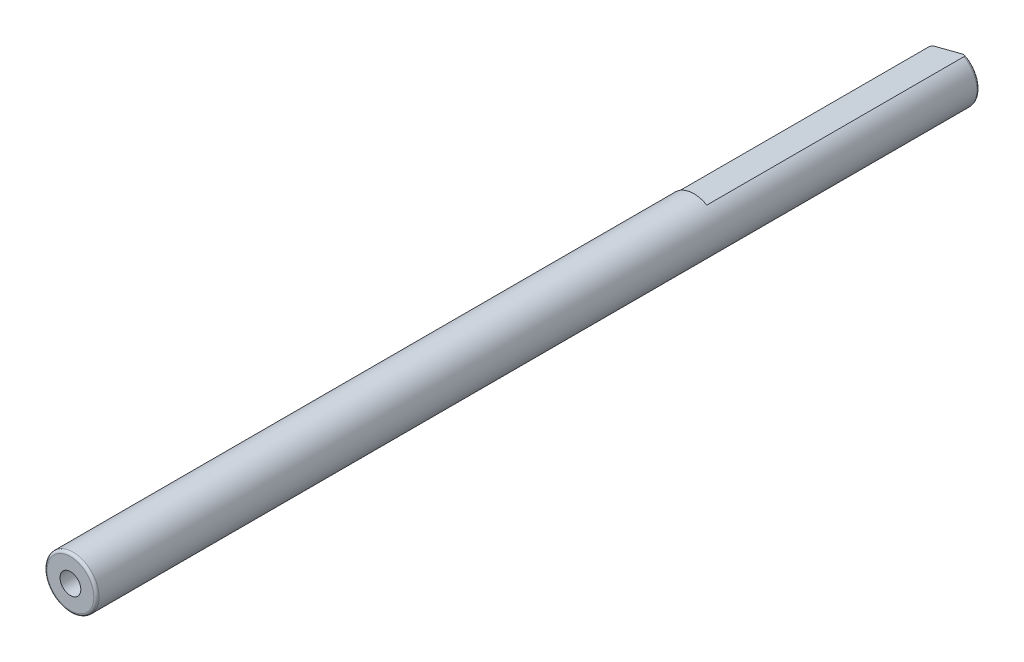
ISO-10303-21;
HEADER;
FILE_DESCRIPTION(('STEP AP214'),'2;1');
FILE_NAME('part.step','',(''),(''),'','','');
FILE_SCHEMA(('AUTOMOTIVE_DESIGN { 1 0 10303 214 1 1 1 1 }'));
ENDSEC;
DATA;
#1=APPLICATION_CONTEXT('core data for automotive mechanical design processes');
#2=APPLICATION_PROTOCOL_DEFINITION('international standard','automotive_design',2000,#1);
#3=PRODUCT_CONTEXT('',#1,'mechanical');
#4=PRODUCT('Part','Part','',(#3));
#5=PRODUCT_RELATED_PRODUCT_CATEGORY('part','',(#4));
#6=PRODUCT_DEFINITION_FORMATION('','',#4);
#7=PRODUCT_DEFINITION_CONTEXT('part definition',#1,'design');
#8=PRODUCT_DEFINITION('design','',#6,#7);
#9=PRODUCT_DEFINITION_SHAPE('','',#8);
#10=(LENGTH_UNIT() NAMED_UNIT(*) SI_UNIT(.MILLI.,.METRE.));
#11=(NAMED_UNIT(*) PLANE_ANGLE_UNIT() SI_UNIT($,.RADIAN.));
#12=(NAMED_UNIT(*) SI_UNIT($,.STERADIAN.) SOLID_ANGLE_UNIT());
#13=UNCERTAINTY_MEASURE_WITH_UNIT(LENGTH_MEASURE(1.E-05),#10,'distance_accuracy_value','');
#14=(GEOMETRIC_REPRESENTATION_CONTEXT(3) GLOBAL_UNCERTAINTY_ASSIGNED_CONTEXT((#13)) GLOBAL_UNIT_ASSIGNED_CONTEXT((#10,
#11,#12)) REPRESENTATION_CONTEXT('',''));
#15=CARTESIAN_POINT('',(0.,0.,0.));
#16=DIRECTION('',(0.,0.,1.));
#17=DIRECTION('',(1.,0.,0.));
#18=AXIS2_PLACEMENT_3D('',#15,#16,#17);
#19=CARTESIAN_POINT('',(0.,0.,-85.));
#20=DIRECTION('',(0.,0.,1.));
#21=DIRECTION('',(-1.,0.,0.));
#22=AXIS2_PLACEMENT_3D('',#19,#20,#21);
#23=CYLINDRICAL_SURFACE('',#22,2.5);
#24=CARTESIAN_POINT('',(0.,0.,-84.75));
#25=DIRECTION('',(0.,0.,1.));
#26=DIRECTION('',(1.,0.,0.));
#27=AXIS2_PLACEMENT_3D('',#24,#25,#26);
#28=CIRCLE('',#27,2.5);
#29=CARTESIAN_POINT('',(1.24656963311538,2.16704041258916,-84.75));
#30=VERTEX_POINT('',#29);
#31=CARTESIAN_POINT('',(-2.14167556849486,1.28966110250416,-84.75));
#32=VERTEX_POINT('',#31);
#33=EDGE_CURVE('E103',#30,#32,#28,.F.);
#34=ORIENTED_EDGE('',*,*,#33,.F.);
#35=DIRECTION('',(0.,0.,-1.));
#36=VECTOR('',#35,1.);
#37=CARTESIAN_POINT('',(1.24656963311538,2.16704041258916,-60.));
#38=LINE('',#37,#36);
#39=CARTESIAN_POINT('',(1.24656963311538,2.16704041258916,-60.));
#40=VERTEX_POINT('',#39);
#41=EDGE_CURVE('E83',#40,#30,#38,.T.);
#42=ORIENTED_EDGE('',*,*,#41,.F.);
#43=CARTESIAN_POINT('',(0.,0.,-60.));
#44=DIRECTION('',(0.,0.,1.));
#45=DIRECTION('',(1.,0.,0.));
#46=AXIS2_PLACEMENT_3D('',#43,#44,#45);
#47=CIRCLE('',#46,2.5);
#48=CARTESIAN_POINT('',(-2.14167556849486,1.28966110250416,-60.));
#49=VERTEX_POINT('',#48);
#50=EDGE_CURVE('E76',#40,#49,#47,.T.);
#51=ORIENTED_EDGE('',*,*,#50,.T.);
#52=DIRECTION('',(0.,0.,-1.));
#53=VECTOR('',#52,1.);
#54=CARTESIAN_POINT('',(-2.14167556849486,1.28966110250416,-60.));
#55=LINE('',#54,#53);
#56=EDGE_CURVE('E78',#49,#32,#55,.T.);
#57=ORIENTED_EDGE('',*,*,#56,.T.);
#58=EDGE_LOOP('',(#34,#42,#51,#57));
#59=FACE_BOUND('',#58,.T.);
#60=CARTESIAN_POINT('',(0.,0.,-0.25));
#61=DIRECTION('',(0.,0.,1.));
#62=DIRECTION('',(1.,0.,0.));
#63=AXIS2_PLACEMENT_3D('',#60,#61,#62);
#64=CIRCLE('',#63,2.5);
#65=CARTESIAN_POINT('',(2.5,0.,-0.25));
#66=VERTEX_POINT('',#65);
#67=EDGE_CURVE('E100',#66,#66,#64,.T.);
#68=ORIENTED_EDGE('',*,*,#67,.F.);
#69=EDGE_LOOP('',(#68));
#70=FACE_BOUND('',#69,.T.);
#71=ADVANCED_FACE('F35',(#59,#70),#23,.T.);
#72=CARTESIAN_POINT('',(0.,0.,-85.));
#73=DIRECTION('',(0.,0.,-1.));
#74=DIRECTION('',(1.,0.,0.));
#75=AXIS2_PLACEMENT_3D('',#72,#73,#74);
#76=PLANE('',#75);
#77=DIRECTION('',(0.968070057602924,0.250679802881428,0.));
#78=VECTOR('',#77,1.);
#79=CARTESIAN_POINT('',(-2.14167556849486,1.28966110250416,-85.));
#80=LINE('',#79,#78);
#81=CARTESIAN_POINT('',(-1.77313748717586,1.38509330067389,-85.));
#82=VERTEX_POINT('',#81);
#83=CARTESIAN_POINT('',(0.87803155179638,2.07160821441943,-85.));
#84=VERTEX_POINT('',#83);
#85=EDGE_CURVE('E86',#82,#84,#80,.T.);
#86=ORIENTED_EDGE('',*,*,#85,.T.);
#87=CARTESIAN_POINT('',(0.,0.,-85.));
#88=DIRECTION('',(0.,0.,1.));
#89=DIRECTION('',(1.,0.,0.));
#90=AXIS2_PLACEMENT_3D('',#87,#88,#89);
#91=CIRCLE('',#90,2.25);
#92=EDGE_CURVE('E98',#82,#84,#91,.T.);
#93=ORIENTED_EDGE('',*,*,#92,.F.);
#94=EDGE_LOOP('',(#86,#93));
#95=FACE_BOUND('',#94,.T.);
#96=CARTESIAN_POINT('',(0.,0.,-85.));
#97=DIRECTION('',(0.,0.,1.));
#98=DIRECTION('',(1.,0.,0.));
#99=AXIS2_PLACEMENT_3D('',#96,#97,#98);
#100=CIRCLE('',#99,1.25);
#101=CARTESIAN_POINT('',(1.25,0.,-85.));
#102=VERTEX_POINT('',#101);
#103=EDGE_CURVE('E95',#102,#102,#100,.F.);
#104=ORIENTED_EDGE('',*,*,#103,.F.);
#105=EDGE_LOOP('',(#104));
#106=FACE_BOUND('',#105,.T.);
#107=ADVANCED_FACE('F132',(#95,#106),#76,.T.);
#108=CARTESIAN_POINT('',(0.,0.,0.));
#109=DIRECTION('',(0.,0.,-1.));
#110=DIRECTION('',(1.,0.,0.));
#111=AXIS2_PLACEMENT_3D('',#108,#109,#110);
#112=PLANE('',#111);
#113=CARTESIAN_POINT('',(0.,0.,0.));
#114=DIRECTION('',(0.,0.,1.));
#115=DIRECTION('',(1.,0.,0.));
#116=AXIS2_PLACEMENT_3D('',#113,#114,#115);
#117=CIRCLE('',#116,2.25);
#118=CARTESIAN_POINT('',(2.25,0.,0.));
#119=VERTEX_POINT('',#118);
#120=EDGE_CURVE('E108',#119,#119,#117,.F.);
#121=ORIENTED_EDGE('',*,*,#120,.F.);
#122=EDGE_LOOP('',(#121));
#123=FACE_BOUND('',#122,.T.);
#124=CARTESIAN_POINT('',(0.,0.,0.));
#125=DIRECTION('',(0.,0.,1.));
#126=DIRECTION('',(1.,0.,0.));
#127=AXIS2_PLACEMENT_3D('',#124,#125,#126);
#128=CIRCLE('',#127,1.);
#129=CARTESIAN_POINT('',(1.,0.,0.));
#130=VERTEX_POINT('',#129);
#131=EDGE_CURVE('E91',#130,#130,#128,.T.);
#132=ORIENTED_EDGE('',*,*,#131,.F.);
#133=EDGE_LOOP('',(#132));
#134=FACE_BOUND('',#133,.T.);
#135=ADVANCED_FACE('F136',(#123,#134),#112,.F.);
#136=CARTESIAN_POINT('',(0.,0.,0.));
#137=DIRECTION('',(0.,0.,-1.));
#138=DIRECTION('',(1.,0.,0.));
#139=AXIS2_PLACEMENT_3D('',#136,#137,#138);
#140=CYLINDRICAL_SURFACE('',#139,1.);
#141=CARTESIAN_POINT('',(0.,0.,-84.75));
#142=DIRECTION('',(0.,0.,1.));
#143=DIRECTION('',(1.,0.,0.));
#144=AXIS2_PLACEMENT_3D('',#141,#142,#143);
#145=CIRCLE('',#144,1.);
#146=CARTESIAN_POINT('',(1.,0.,-84.75));
#147=VERTEX_POINT('',#146);
#148=EDGE_CURVE('E105',#147,#147,#145,.T.);
#149=ORIENTED_EDGE('',*,*,#148,.F.);
#150=EDGE_LOOP('',(#149));
#151=FACE_BOUND('',#150,.T.);
#152=ORIENTED_EDGE('',*,*,#131,.T.);
#153=EDGE_LOOP('',(#152));
#154=FACE_BOUND('',#153,.T.);
#155=ADVANCED_FACE('F121',(#151,#154),#140,.F.);
#156=CARTESIAN_POINT('',(0.,0.,-84.75));
#157=DIRECTION('',(0.,0.,-1.));
#158=DIRECTION('',(1.,0.,0.));
#159=AXIS2_PLACEMENT_3D('',#156,#157,#158);
#160=TOROIDAL_SURFACE('',#159,2.25,0.25);
#161=CARTESIAN_POINT('',(0.425053761878825,1.95431052279639,-84.7498));
#162=CARTESIAN_POINT('',(0.425022132917158,1.95430233254011,-84.7568191708284));
#163=CARTESIAN_POINT('',(0.425663766025406,1.95446848214863,-84.7638122340751));
#164=CARTESIAN_POINT('',(0.428110624978154,1.95510209137468,-84.7774897210039));
#165=CARTESIAN_POINT('',(0.429900948447859,1.95556569205208,-84.7841769388553));
#166=CARTESIAN_POINT('',(0.435087518952933,1.9569087440984,-84.7989295884776));
#167=CARTESIAN_POINT('',(0.438787022899222,1.95786672323713,-84.8068790375475));
#168=CARTESIAN_POINT('',(0.447370133828811,1.9600893026249,-84.8220962902687));
#169=CARTESIAN_POINT('',(0.452260267760066,1.96135559301403,-84.8293600193247));
#170=CARTESIAN_POINT('',(0.466411005574552,1.96501989823461,-84.8478095285237));
#171=CARTESIAN_POINT('',(0.476412152265188,1.96760967514312,-84.858382460304));
#172=CARTESIAN_POINT('',(0.497755111910061,1.97313639180444,-84.8779326565168));
#173=CARTESIAN_POINT('',(0.509099667963738,1.97607404187736,-84.8869065590171));
#174=CARTESIAN_POINT('',(0.543753589675399,1.98504760551103,-84.9114391675026));
#175=CARTESIAN_POINT('',(0.56824261872814,1.9913889905456,-84.925210853844));
#176=CARTESIAN_POINT('',(0.618834247949331,2.00448959162402,-84.9490780861197));
#177=CARTESIAN_POINT('',(0.644941506733713,2.01125001400714,-84.9591623814683));
#178=CARTESIAN_POINT('',(0.709640716167357,2.02800374473151,-84.9797134317033));
#179=CARTESIAN_POINT('',(0.748752500252955,2.03813166290016,-84.9884623523169));
#180=CARTESIAN_POINT('',(0.827804175518326,2.05860193591122,-84.999201566197));
#181=CARTESIAN_POINT('',(0.867742736155735,2.06894394621236,-85.0012019804268));
#182=CARTESIAN_POINT('',(0.933553221984782,2.08598543973403,-84.9980587220651));
#183=CARTESIAN_POINT('',(0.959526473161087,2.09271116111538,-84.9951407949997));
#184=CARTESIAN_POINT('',(1.0107922624953,2.10598633460508,-84.9854326805404));
#185=CARTESIAN_POINT('',(1.03608594450483,2.11253608291151,-84.9786494906682));
#186=CARTESIAN_POINT('',(1.07777015711749,2.12333012629602,-84.9632422670608));
#187=CARTESIAN_POINT('',(1.09456021063539,2.12767787703284,-84.9557762430456));
#188=CARTESIAN_POINT('',(1.12687777728902,2.13604644620272,-84.9383188566183));
#189=CARTESIAN_POINT('',(1.142406952852,2.14006769511799,-84.9283308931783));
#190=CARTESIAN_POINT('',(1.16754582153321,2.14657735482306,-84.9086403937822));
#191=CARTESIAN_POINT('',(1.17762557139123,2.14918748586436,-84.8995808367024));
#192=CARTESIAN_POINT('',(1.19628625750905,2.15401963316704,-84.8799320402253));
#193=CARTESIAN_POINT('',(1.20486906917711,2.15624213506163,-84.8693447456724));
#194=CARTESIAN_POINT('',(1.21854421977081,2.15978328792374,-84.848925051505));
#195=CARTESIAN_POINT('',(1.22399078376004,2.16119366476215,-84.8393467472286));
#196=CARTESIAN_POINT('',(1.23327484376571,2.16359775350953,-84.8193989029678));
#197=CARTESIAN_POINT('',(1.23711559806018,2.16459230914307,-84.8090310161521));
#198=CARTESIAN_POINT('',(1.2421786434389,2.16590337460527,-84.7905112509126));
#199=CARTESIAN_POINT('',(1.24382143998123,2.16632877348025,-84.7824807397061));
#200=CARTESIAN_POINT('',(1.24602692076251,2.16689987831215,-84.7662365219919));
#201=CARTESIAN_POINT('',(1.24658597471944,2.16704464421481,-84.7580222926771));
#202=CARTESIAN_POINT('',(1.24656952247878,2.16704038394003,-84.7498));
#203=B_SPLINE_CURVE_WITH_KNOTS('',3,(#161,#162,#163,#164,#165,#166,#167,#168,#169,#170,#171,
#172,#173,#174,#175,#176,#177,#178,#179,#180,#181,#182,#183,#184,#185,#186,#187,#188,#189,#190,
#191,#192,#193,#194,#195,#196,#197,#198,#199,#200,#201,#202),.UNSPECIFIED.,.F.,.F.,(4,2,2,2,2,2,
2,2,2,2,2,2,2,2,2,2,2,2,2,2,4),(0.,0.0209811316456926,0.0416954249068607,0.0680081601276865,
0.0944685227141209,0.138565568306266,0.182754260482958,0.268683116398199,0.354872004046447,
0.478305717839832,0.601554231424503,0.682300505968247,0.762901062907967,0.819386018763245,
0.875795248991933,0.917063473857081,0.958279619371743,0.991474295494567,1.02460128698995,
1.04915022391161,1.07378125284237),.UNSPECIFIED.);
#204=EDGE_CURVE('E11',#84,#30,#203,.T.);
#205=ORIENTED_EDGE('',*,*,#204,.T.);
#206=ORIENTED_EDGE('',*,*,#33,.T.);
#207=CARTESIAN_POINT('',(-2.14167545785826,1.28966113115328,-84.7498));
#208=CARTESIAN_POINT('',(-2.14171224821897,1.28965160436305,-84.7608512320649));
#209=CARTESIAN_POINT('',(-2.1406882898033,1.28991675634434,-84.7718778596826));
#210=CARTESIAN_POINT('',(-2.13672949595835,1.29094187808311,-84.7934679845931));
#211=CARTESIAN_POINT('',(-2.13381060670334,1.29169771861069,-84.8040345684732));
#212=CARTESIAN_POINT('',(-2.12627592797966,1.29364880857819,-84.8244598014821));
#213=CARTESIAN_POINT('',(-2.12166433479978,1.29484297139753,-84.8343201298147));
#214=CARTESIAN_POINT('',(-2.11102048240825,1.29759917566028,-84.8531993834641));
#215=CARTESIAN_POINT('',(-2.10498523707209,1.29916199035466,-84.8622164838176));
#216=CARTESIAN_POINT('',(-2.0891899522798,1.30325214772198,-84.8826445990604));
#217=CARTESIAN_POINT('',(-2.07889587767031,1.30591777772849,-84.8936145679418));
#218=CARTESIAN_POINT('',(-2.05674323972074,1.31165415896546,-84.913704852529));
#219=CARTESIAN_POINT('',(-2.04488185384281,1.31472564108644,-84.9228217540616));
#220=CARTESIAN_POINT('',(-2.01463923624281,1.32255690635391,-84.9429234816592));
#221=CARTESIAN_POINT('',(-1.99567906199685,1.32746660550765,-84.9529755173965));
#222=CARTESIAN_POINT('',(-1.95648977092357,1.33761459395555,-84.9698986634325));
#223=CARTESIAN_POINT('',(-1.93625851453852,1.3428534372839,-84.976764237885));
#224=CARTESIAN_POINT('',(-1.88499761051522,1.35612734573212,-84.9904238258284));
#225=CARTESIAN_POINT('',(-1.85354701366388,1.36427141480778,-84.9955247727872));
#226=CARTESIAN_POINT('',(-1.79026637803352,1.38065780868645,-85.0006140303183));
#227=CARTESIAN_POINT('',(-1.75843570940059,1.38890029658887,-85.0005921604285));
#228=CARTESIAN_POINT('',(-1.69375656590205,1.40564883127953,-84.9959772907134));
#229=CARTESIAN_POINT('',(-1.66092152783862,1.41415139863476,-84.9911922444688));
#230=CARTESIAN_POINT('',(-1.59622233372271,1.43090512539264,-84.9770835016307));
#231=CARTESIAN_POINT('',(-1.56435653492472,1.43915671018095,-84.9677679983586));
#232=CARTESIAN_POINT('',(-1.51483782482241,1.45197948100203,-84.9490673304093));
#233=CARTESIAN_POINT('',(-1.49663274338225,1.45669365038576,-84.94122337951));
#234=CARTESIAN_POINT('',(-1.46108703977681,1.46589813915505,-84.9235948533831));
#235=CARTESIAN_POINT('',(-1.44374678402905,1.47038836365753,-84.9138094641841));
#236=CARTESIAN_POINT('',(-1.41442343807823,1.47798158537227,-84.8944774764691));
#237=CARTESIAN_POINT('',(-1.40214106281724,1.48116208185096,-84.8854183256589));
#238=CARTESIAN_POINT('',(-1.37891012176449,1.48717768751722,-84.8656223205263));
#239=CARTESIAN_POINT('',(-1.36795745382673,1.49001385894728,-84.8548908719589));
#240=CARTESIAN_POINT('',(-1.352963863115,1.49389641923781,-84.8368992875672));
#241=CARTESIAN_POINT('',(-1.3480949394441,1.4951572172725,-84.8303803125725));
#242=CARTESIAN_POINT('',(-1.33924979716044,1.49744764915469,-84.8167162472778));
#243=CARTESIAN_POINT('',(-1.33527285515301,1.49847747032379,-84.8095716709255));
#244=CARTESIAN_POINT('',(-1.32905451564143,1.50008769688825,-84.7958487143419));
#245=CARTESIAN_POINT('',(-1.3266392320052,1.50071312974931,-84.7893556231265));
#246=CARTESIAN_POINT('',(-1.32288936105379,1.50168415132316,-84.7760518240812));
#247=CARTESIAN_POINT('',(-1.32155183705663,1.50203050048387,-84.7692420331865));
#248=CARTESIAN_POINT('',(-1.32037065527532,1.50233636514085,-84.7581947002053));
#249=CARTESIAN_POINT('',(-1.32014654500396,1.50239439804685,-84.7539976675758));
#250=CARTESIAN_POINT('',(-1.32015969725831,1.50239099229692,-84.7498));
#251=B_SPLINE_CURVE_WITH_KNOTS('',3,(#207,#208,#209,#210,#211,#212,#213,#214,#215,#216,#217,
#218,#219,#220,#221,#222,#223,#224,#225,#226,#227,#228,#229,#230,#231,#232,#233,#234,#235,#236,
#237,#238,#239,#240,#241,#242,#243,#244,#245,#246,#247,#248,#249,#250),.UNSPECIFIED.,.F.,.F.,(4,
2,2,2,2,2,2,2,2,2,2,2,2,2,2,2,2,2,2,2,2,4),(0.,0.0330610723724453,0.0658474745302223,
0.0985531407062349,0.13132802708968,0.176907495817816,0.222570195781612,0.28824746892834,
0.354038420136997,0.452159469521612,0.550475514375829,0.652922931865517,0.755185758550748,
0.816233715408757,0.877307321655502,0.923984365944858,0.970513540841106,0.995159236920087,
1.01978487254745,1.04057268476436,1.06130366092345,1.07389006473428),.UNSPECIFIED.);
#252=EDGE_CURVE('E48',#32,#82,#251,.T.);
#253=ORIENTED_EDGE('',*,*,#252,.T.);
#254=ORIENTED_EDGE('',*,*,#92,.T.);
#255=EDGE_LOOP('',(#205,#206,#253,#254));
#256=FACE_BOUND('',#255,.T.);
#257=ADVANCED_FACE('F116',(#256),#160,.T.);
#258=CARTESIAN_POINT('',(0.,0.,-84.75));
#259=DIRECTION('',(0.,0.,-1.));
#260=DIRECTION('',(1.,0.,0.));
#261=AXIS2_PLACEMENT_3D('',#258,#259,#260);
#262=TOROIDAL_SURFACE('',#261,1.25,0.25);
#263=ORIENTED_EDGE('',*,*,#103,.T.);
#264=EDGE_LOOP('',(#263));
#265=FACE_BOUND('',#264,.T.);
#266=ORIENTED_EDGE('',*,*,#148,.T.);
#267=EDGE_LOOP('',(#266));
#268=FACE_BOUND('',#267,.T.);
#269=ADVANCED_FACE('F120',(#265,#268),#262,.T.);
#270=CARTESIAN_POINT('',(0.,0.,-0.25));
#271=DIRECTION('',(0.,0.,-1.));
#272=DIRECTION('',(1.,0.,0.));
#273=AXIS2_PLACEMENT_3D('',#270,#271,#272);
#274=TOROIDAL_SURFACE('',#273,2.25,0.25);
#275=ORIENTED_EDGE('',*,*,#120,.T.);
#276=EDGE_LOOP('',(#275));
#277=FACE_BOUND('',#276,.T.);
#278=ORIENTED_EDGE('',*,*,#67,.T.);
#279=EDGE_LOOP('',(#278));
#280=FACE_BOUND('',#279,.T.);
#281=ADVANCED_FACE('F37',(#277,#280),#274,.T.);
#282=CARTESIAN_POINT('',(-2.14167556849486,1.28966110250416,-60.));
#283=DIRECTION('',(0.250679802881428,-0.968070057602924,0.));
#284=DIRECTION('',(0.968070057602924,0.250679802881428,0.));
#285=AXIS2_PLACEMENT_3D('',#282,#283,#284);
#286=PLANE('',#285);
#287=ORIENTED_EDGE('',*,*,#204,.F.);
#288=ORIENTED_EDGE('',*,*,#85,.F.);
#289=ORIENTED_EDGE('',*,*,#252,.F.);
#290=ORIENTED_EDGE('',*,*,#56,.F.);
#291=DIRECTION('',(0.968070057602924,0.250679802881428,0.));
#292=VECTOR('',#291,1.);
#293=CARTESIAN_POINT('',(-2.14167556849486,1.28966110250416,-60.));
#294=LINE('',#293,#292);
#295=EDGE_CURVE('E73',#49,#40,#294,.T.);
#296=ORIENTED_EDGE('',*,*,#295,.T.);
#297=ORIENTED_EDGE('',*,*,#41,.T.);
#298=EDGE_LOOP('',(#287,#288,#289,#290,#296,#297));
#299=FACE_BOUND('',#298,.T.);
#300=ADVANCED_FACE('F80',(#299),#286,.F.);
#301=CARTESIAN_POINT('',(0.,0.,-60.));
#302=DIRECTION('',(0.,0.,-1.));
#303=DIRECTION('',(1.,0.,0.));
#304=AXIS2_PLACEMENT_3D('',#301,#302,#303);
#305=PLANE('',#304);
#306=ORIENTED_EDGE('',*,*,#50,.F.);
#307=ORIENTED_EDGE('',*,*,#295,.F.);
#308=EDGE_LOOP('',(#306,#307));
#309=FACE_BOUND('',#308,.T.);
#310=ADVANCED_FACE('F74',(#309),#305,.T.);
#311=CLOSED_SHELL('',(#71,#107,#135,#155,#257,#269,#281,#300,#310));
#312=MANIFOLD_SOLID_BREP('B2',#311);
#313=ADVANCED_BREP_SHAPE_REPRESENTATION('',(#18,#312),#14);
#314=SHAPE_DEFINITION_REPRESENTATION(#9,#313);
ENDSEC;
END-ISO-10303-21;
